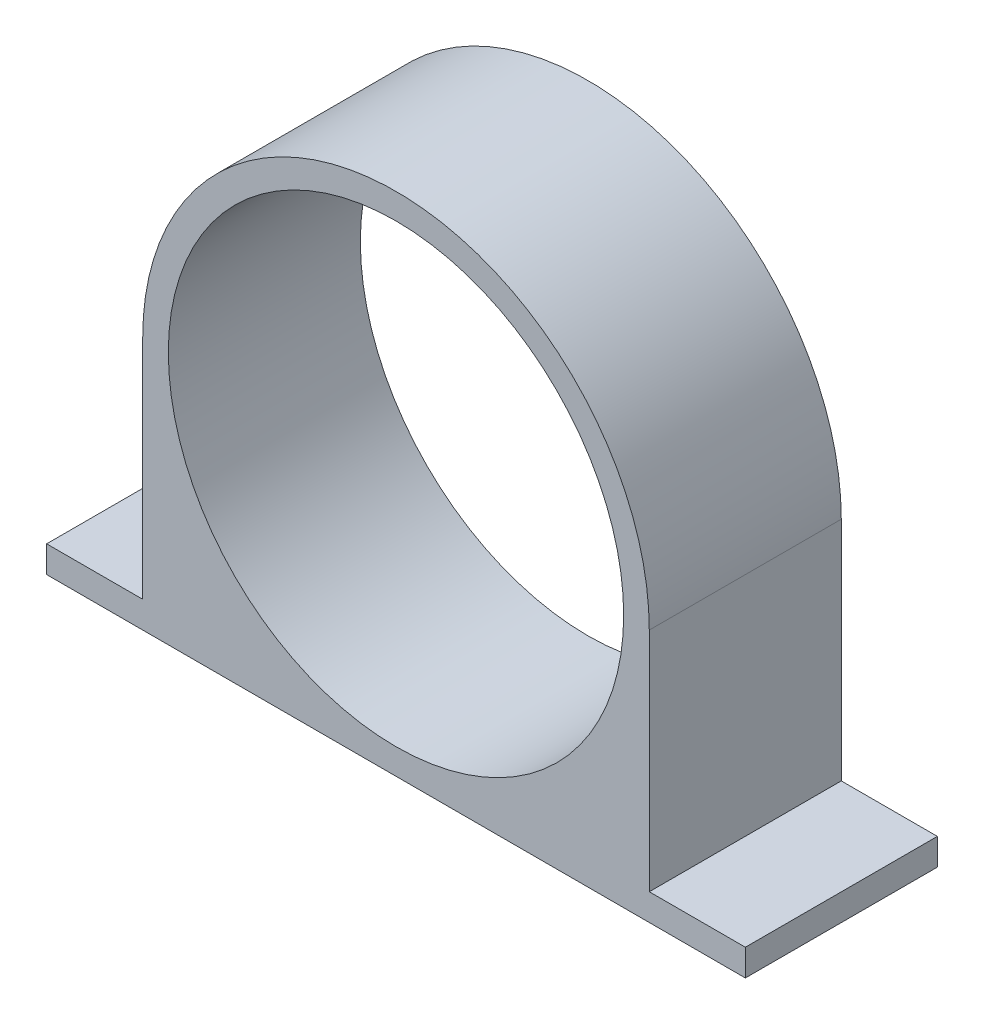
ISO-10303-21;
HEADER;
FILE_DESCRIPTION(('STEP AP214'),'2;1');
FILE_NAME('part.step','',(''),(''),'','','');
FILE_SCHEMA(('AUTOMOTIVE_DESIGN { 1 0 10303 214 1 1 1 1 }'));
ENDSEC;
DATA;
#1=APPLICATION_CONTEXT('core data for automotive mechanical design processes');
#2=APPLICATION_PROTOCOL_DEFINITION('international standard','automotive_design',2000,#1);
#3=PRODUCT_CONTEXT('',#1,'mechanical');
#4=PRODUCT('Part','Part','',(#3));
#5=PRODUCT_RELATED_PRODUCT_CATEGORY('part','',(#4));
#6=PRODUCT_DEFINITION_FORMATION('','',#4);
#7=PRODUCT_DEFINITION_CONTEXT('part definition',#1,'design');
#8=PRODUCT_DEFINITION('design','',#6,#7);
#9=PRODUCT_DEFINITION_SHAPE('','',#8);
#10=(LENGTH_UNIT() NAMED_UNIT(*) SI_UNIT(.MILLI.,.METRE.));
#11=(NAMED_UNIT(*) PLANE_ANGLE_UNIT() SI_UNIT($,.RADIAN.));
#12=(NAMED_UNIT(*) SI_UNIT($,.STERADIAN.) SOLID_ANGLE_UNIT());
#13=UNCERTAINTY_MEASURE_WITH_UNIT(LENGTH_MEASURE(1.E-05),#10,'distance_accuracy_value','');
#14=(GEOMETRIC_REPRESENTATION_CONTEXT(3) GLOBAL_UNCERTAINTY_ASSIGNED_CONTEXT((#13)) GLOBAL_UNIT_ASSIGNED_CONTEXT((#10,
#11,#12)) REPRESENTATION_CONTEXT('',''));
#15=CARTESIAN_POINT('',(0.,0.,0.));
#16=DIRECTION('',(0.,0.,1.));
#17=DIRECTION('',(1.,0.,0.));
#18=AXIS2_PLACEMENT_3D('',#15,#16,#17);
#19=CARTESIAN_POINT('',(0.,0.,25.3));
#20=DIRECTION('',(0.,0.,-1.));
#21=DIRECTION('',(-1.,0.,0.));
#22=AXIS2_PLACEMENT_3D('',#19,#20,#21);
#23=CYLINDRICAL_SURFACE('',#22,33.375);
#24=CARTESIAN_POINT('',(0.,0.,25.3));
#25=DIRECTION('',(0.,0.,1.));
#26=DIRECTION('',(1.,0.,0.));
#27=AXIS2_PLACEMENT_3D('',#24,#25,#26);
#28=CIRCLE('',#27,33.375);
#29=CARTESIAN_POINT('',(33.375,0.,25.3));
#30=VERTEX_POINT('',#29);
#31=CARTESIAN_POINT('',(-33.375,0.,25.3));
#32=VERTEX_POINT('',#31);
#33=EDGE_CURVE('E145',#30,#32,#28,.T.);
#34=ORIENTED_EDGE('',*,*,#33,.F.);
#35=DIRECTION('',(0.,0.,-1.));
#36=VECTOR('',#35,1.);
#37=CARTESIAN_POINT('',(33.375,0.,0.));
#38=LINE('',#37,#36);
#39=CARTESIAN_POINT('',(33.375,0.,0.));
#40=VERTEX_POINT('',#39);
#41=EDGE_CURVE('E140',#30,#40,#38,.T.);
#42=ORIENTED_EDGE('',*,*,#41,.T.);
#43=CARTESIAN_POINT('',(0.,0.,0.));
#44=DIRECTION('',(0.,0.,1.));
#45=DIRECTION('',(1.,0.,0.));
#46=AXIS2_PLACEMENT_3D('',#43,#44,#45);
#47=CIRCLE('',#46,33.375);
#48=CARTESIAN_POINT('',(-33.375,0.,0.));
#49=VERTEX_POINT('',#48);
#50=EDGE_CURVE('E147',#40,#49,#47,.T.);
#51=ORIENTED_EDGE('',*,*,#50,.T.);
#52=DIRECTION('',(0.,0.,1.));
#53=VECTOR('',#52,1.);
#54=CARTESIAN_POINT('',(-33.375,0.,0.));
#55=LINE('',#54,#53);
#56=EDGE_CURVE('E137',#49,#32,#55,.T.);
#57=ORIENTED_EDGE('',*,*,#56,.T.);
#58=EDGE_LOOP('',(#34,#42,#51,#57));
#59=FACE_BOUND('',#58,.T.);
#60=ADVANCED_FACE('F63',(#59),#23,.T.);
#61=CARTESIAN_POINT('',(0.,0.,0.));
#62=DIRECTION('',(0.,0.,1.));
#63=DIRECTION('',(1.,0.,0.));
#64=AXIS2_PLACEMENT_3D('',#61,#62,#63);
#65=PLANE('',#64);
#66=CARTESIAN_POINT('',(0.,0.,0.));
#67=DIRECTION('',(0.,0.,-1.));
#68=DIRECTION('',(-1.,0.,0.));
#69=AXIS2_PLACEMENT_3D('',#66,#67,#68);
#70=CIRCLE('',#69,30.);
#71=CARTESIAN_POINT('',(-30.,0.,0.));
#72=VERTEX_POINT('',#71);
#73=EDGE_CURVE('E190',#72,#72,#70,.T.);
#74=ORIENTED_EDGE('',*,*,#73,.F.);
#75=EDGE_LOOP('',(#74));
#76=FACE_BOUND('',#75,.T.);
#77=ORIENTED_EDGE('',*,*,#50,.F.);
#78=DIRECTION('',(0.,1.,0.));
#79=VECTOR('',#78,1.);
#80=CARTESIAN_POINT('',(33.375,-33.3,0.));
#81=LINE('',#80,#79);
#82=CARTESIAN_POINT('',(33.375,-29.8633159844854,0.));
#83=VERTEX_POINT('',#82);
#84=EDGE_CURVE('E186',#83,#40,#81,.T.);
#85=ORIENTED_EDGE('',*,*,#84,.F.);
#86=DIRECTION('',(-1.,0.,0.));
#87=VECTOR('',#86,1.);
#88=CARTESIAN_POINT('',(-46.035,-29.8633159844854,0.));
#89=LINE('',#88,#87);
#90=CARTESIAN_POINT('',(46.035,-29.8633159844854,0.));
#91=VERTEX_POINT('',#90);
#92=EDGE_CURVE('E168',#91,#83,#89,.T.);
#93=ORIENTED_EDGE('',*,*,#92,.F.);
#94=DIRECTION('',(0.,1.,0.));
#95=VECTOR('',#94,1.);
#96=CARTESIAN_POINT('',(46.035,-29.8633159844854,0.));
#97=LINE('',#96,#95);
#98=CARTESIAN_POINT('',(46.035,-33.375,0.));
#99=VERTEX_POINT('',#98);
#100=EDGE_CURVE('E172',#99,#91,#97,.T.);
#101=ORIENTED_EDGE('',*,*,#100,.F.);
#102=DIRECTION('',(1.,0.,0.));
#103=VECTOR('',#102,1.);
#104=CARTESIAN_POINT('',(-46.035,-33.375,0.));
#105=LINE('',#104,#103);
#106=CARTESIAN_POINT('',(-46.035,-33.375,0.));
#107=VERTEX_POINT('',#106);
#108=EDGE_CURVE('E174',#107,#99,#105,.T.);
#109=ORIENTED_EDGE('',*,*,#108,.F.);
#110=DIRECTION('',(0.,-1.,0.));
#111=VECTOR('',#110,1.);
#112=CARTESIAN_POINT('',(-46.035,-29.8633159844854,0.));
#113=LINE('',#112,#111);
#114=CARTESIAN_POINT('',(-46.035,-29.8633159844854,0.));
#115=VERTEX_POINT('',#114);
#116=EDGE_CURVE('E176',#115,#107,#113,.T.);
#117=ORIENTED_EDGE('',*,*,#116,.F.);
#118=CARTESIAN_POINT('',(-33.375,-29.8633159844854,0.));
#119=VERTEX_POINT('',#118);
#120=EDGE_CURVE('E105',#119,#115,#89,.T.);
#121=ORIENTED_EDGE('',*,*,#120,.F.);
#122=DIRECTION('',(0.,1.,0.));
#123=VECTOR('',#122,1.);
#124=CARTESIAN_POINT('',(-33.375,-33.3,0.));
#125=LINE('',#124,#123);
#126=EDGE_CURVE('E179',#119,#49,#125,.T.);
#127=ORIENTED_EDGE('',*,*,#126,.T.);
#128=EDGE_LOOP('',(#77,#85,#93,#101,#109,#117,#121,#127));
#129=FACE_BOUND('',#128,.T.);
#130=ADVANCED_FACE('F201',(#76,#129),#65,.F.);
#131=CARTESIAN_POINT('',(0.,0.,25.3));
#132=DIRECTION('',(0.,0.,1.));
#133=DIRECTION('',(1.,0.,0.));
#134=AXIS2_PLACEMENT_3D('',#131,#132,#133);
#135=PLANE('',#134);
#136=CARTESIAN_POINT('',(0.,0.,25.3));
#137=DIRECTION('',(0.,0.,1.));
#138=DIRECTION('',(1.,0.,0.));
#139=AXIS2_PLACEMENT_3D('',#136,#137,#138);
#140=CIRCLE('',#139,30.);
#141=CARTESIAN_POINT('',(30.,0.,25.3));
#142=VERTEX_POINT('',#141);
#143=EDGE_CURVE('E66',#142,#142,#140,.T.);
#144=ORIENTED_EDGE('',*,*,#143,.F.);
#145=EDGE_LOOP('',(#144));
#146=FACE_BOUND('',#145,.T.);
#147=DIRECTION('',(0.,1.,0.));
#148=VECTOR('',#147,1.);
#149=CARTESIAN_POINT('',(33.375,-33.3,25.3));
#150=LINE('',#149,#148);
#151=CARTESIAN_POINT('',(33.375,-29.8633159844854,25.3));
#152=VERTEX_POINT('',#151);
#153=EDGE_CURVE('E139',#152,#30,#150,.T.);
#154=ORIENTED_EDGE('',*,*,#153,.T.);
#155=ORIENTED_EDGE('',*,*,#33,.T.);
#156=DIRECTION('',(0.,1.,0.));
#157=VECTOR('',#156,1.);
#158=CARTESIAN_POINT('',(-33.375,-33.3,25.3));
#159=LINE('',#158,#157);
#160=CARTESIAN_POINT('',(-33.375,-29.8633159844854,25.3));
#161=VERTEX_POINT('',#160);
#162=EDGE_CURVE('E78',#161,#32,#159,.T.);
#163=ORIENTED_EDGE('',*,*,#162,.F.);
#164=DIRECTION('',(-1.,0.,0.));
#165=VECTOR('',#164,1.);
#166=CARTESIAN_POINT('',(-46.035,-29.8633159844854,25.3));
#167=LINE('',#166,#165);
#168=CARTESIAN_POINT('',(-46.035,-29.8633159844854,25.3));
#169=VERTEX_POINT('',#168);
#170=EDGE_CURVE('E84',#161,#169,#167,.T.);
#171=ORIENTED_EDGE('',*,*,#170,.T.);
#172=DIRECTION('',(0.,-1.,0.));
#173=VECTOR('',#172,1.);
#174=CARTESIAN_POINT('',(-46.035,-29.8633159844854,25.3));
#175=LINE('',#174,#173);
#176=CARTESIAN_POINT('',(-46.035,-33.375,25.3));
#177=VERTEX_POINT('',#176);
#178=EDGE_CURVE('E171',#169,#177,#175,.T.);
#179=ORIENTED_EDGE('',*,*,#178,.T.);
#180=DIRECTION('',(1.,0.,0.));
#181=VECTOR('',#180,1.);
#182=CARTESIAN_POINT('',(-46.035,-33.375,25.3));
#183=LINE('',#182,#181);
#184=CARTESIAN_POINT('',(46.035,-33.375,25.3));
#185=VERTEX_POINT('',#184);
#186=EDGE_CURVE('E113',#177,#185,#183,.T.);
#187=ORIENTED_EDGE('',*,*,#186,.T.);
#188=DIRECTION('',(0.,1.,0.));
#189=VECTOR('',#188,1.);
#190=CARTESIAN_POINT('',(46.035,-29.8633159844854,25.3));
#191=LINE('',#190,#189);
#192=CARTESIAN_POINT('',(46.035,-29.8633159844854,25.3));
#193=VERTEX_POINT('',#192);
#194=EDGE_CURVE('E181',#185,#193,#191,.T.);
#195=ORIENTED_EDGE('',*,*,#194,.T.);
#196=EDGE_CURVE('E167',#193,#152,#167,.T.);
#197=ORIENTED_EDGE('',*,*,#196,.T.);
#198=EDGE_LOOP('',(#154,#155,#163,#171,#179,#187,#195,#197));
#199=FACE_BOUND('',#198,.T.);
#200=ADVANCED_FACE('F149',(#146,#199),#135,.T.);
#201=CARTESIAN_POINT('',(-46.035,-33.375,25.3));
#202=DIRECTION('',(0.,1.,0.));
#203=DIRECTION('',(-1.,0.,0.));
#204=AXIS2_PLACEMENT_3D('',#201,#202,#203);
#205=PLANE('',#204);
#206=DIRECTION('',(0.,0.,-1.));
#207=VECTOR('',#206,1.);
#208=CARTESIAN_POINT('',(46.035,-33.375,25.3));
#209=LINE('',#208,#207);
#210=EDGE_CURVE('E159',#185,#99,#209,.T.);
#211=ORIENTED_EDGE('',*,*,#210,.F.);
#212=ORIENTED_EDGE('',*,*,#186,.F.);
#213=DIRECTION('',(0.,0.,-1.));
#214=VECTOR('',#213,1.);
#215=CARTESIAN_POINT('',(-46.035,-33.375,25.3));
#216=LINE('',#215,#214);
#217=EDGE_CURVE('E155',#177,#107,#216,.T.);
#218=ORIENTED_EDGE('',*,*,#217,.T.);
#219=ORIENTED_EDGE('',*,*,#108,.T.);
#220=EDGE_LOOP('',(#211,#212,#218,#219));
#221=FACE_BOUND('',#220,.T.);
#222=ADVANCED_FACE('F200',(#221),#205,.F.);
#223=CARTESIAN_POINT('',(-46.035,-29.8633159844854,25.3));
#224=DIRECTION('',(0.,-1.,0.));
#225=DIRECTION('',(1.,0.,0.));
#226=AXIS2_PLACEMENT_3D('',#223,#224,#225);
#227=PLANE('',#226);
#228=ORIENTED_EDGE('',*,*,#170,.F.);
#229=DIRECTION('',(0.,0.,-1.));
#230=VECTOR('',#229,1.);
#231=CARTESIAN_POINT('',(-33.375,-29.8633159844854,25.3));
#232=LINE('',#231,#230);
#233=EDGE_CURVE('E12',#161,#119,#232,.T.);
#234=ORIENTED_EDGE('',*,*,#233,.T.);
#235=ORIENTED_EDGE('',*,*,#120,.T.);
#236=DIRECTION('',(0.,0.,-1.));
#237=VECTOR('',#236,1.);
#238=CARTESIAN_POINT('',(-46.035,-29.8633159844854,25.3));
#239=LINE('',#238,#237);
#240=EDGE_CURVE('E165',#169,#115,#239,.T.);
#241=ORIENTED_EDGE('',*,*,#240,.F.);
#242=EDGE_LOOP('',(#228,#234,#235,#241));
#243=FACE_BOUND('',#242,.T.);
#244=ADVANCED_FACE('F208',(#243),#227,.F.);
#245=ORIENTED_EDGE('',*,*,#92,.T.);
#246=DIRECTION('',(0.,0.,1.));
#247=VECTOR('',#246,1.);
#248=CARTESIAN_POINT('',(33.375,-29.8633159844854,25.3));
#249=LINE('',#248,#247);
#250=EDGE_CURVE('E71',#83,#152,#249,.T.);
#251=ORIENTED_EDGE('',*,*,#250,.T.);
#252=ORIENTED_EDGE('',*,*,#196,.F.);
#253=DIRECTION('',(0.,0.,-1.));
#254=VECTOR('',#253,1.);
#255=CARTESIAN_POINT('',(46.035,-29.8633159844854,25.3));
#256=LINE('',#255,#254);
#257=EDGE_CURVE('E162',#193,#91,#256,.T.);
#258=ORIENTED_EDGE('',*,*,#257,.T.);
#259=EDGE_LOOP('',(#245,#251,#252,#258));
#260=FACE_BOUND('',#259,.T.);
#261=ADVANCED_FACE('F228',(#260),#227,.F.);
#262=CARTESIAN_POINT('',(-46.035,-29.8633159844854,25.3));
#263=DIRECTION('',(1.,0.,0.));
#264=DIRECTION('',(0.,0.,-1.));
#265=AXIS2_PLACEMENT_3D('',#262,#263,#264);
#266=PLANE('',#265);
#267=ORIENTED_EDGE('',*,*,#116,.T.);
#268=ORIENTED_EDGE('',*,*,#217,.F.);
#269=ORIENTED_EDGE('',*,*,#178,.F.);
#270=ORIENTED_EDGE('',*,*,#240,.T.);
#271=EDGE_LOOP('',(#267,#268,#269,#270));
#272=FACE_BOUND('',#271,.T.);
#273=ADVANCED_FACE('F237',(#272),#266,.F.);
#274=CARTESIAN_POINT('',(46.035,-29.8633159844854,25.3));
#275=DIRECTION('',(-1.,0.,0.));
#276=DIRECTION('',(0.,0.,1.));
#277=AXIS2_PLACEMENT_3D('',#274,#275,#276);
#278=PLANE('',#277);
#279=ORIENTED_EDGE('',*,*,#100,.T.);
#280=ORIENTED_EDGE('',*,*,#257,.F.);
#281=ORIENTED_EDGE('',*,*,#194,.F.);
#282=ORIENTED_EDGE('',*,*,#210,.T.);
#283=EDGE_LOOP('',(#279,#280,#281,#282));
#284=FACE_BOUND('',#283,.T.);
#285=ADVANCED_FACE('F221',(#284),#278,.F.);
#286=CARTESIAN_POINT('',(33.375,-33.3,0.));
#287=DIRECTION('',(1.,0.,0.));
#288=DIRECTION('',(0.,0.,-1.));
#289=AXIS2_PLACEMENT_3D('',#286,#287,#288);
#290=PLANE('',#289);
#291=ORIENTED_EDGE('',*,*,#250,.F.);
#292=ORIENTED_EDGE('',*,*,#84,.T.);
#293=ORIENTED_EDGE('',*,*,#41,.F.);
#294=ORIENTED_EDGE('',*,*,#153,.F.);
#295=EDGE_LOOP('',(#291,#292,#293,#294));
#296=FACE_BOUND('',#295,.T.);
#297=ADVANCED_FACE('F243',(#296),#290,.T.);
#298=CARTESIAN_POINT('',(-33.375,-33.3,0.));
#299=DIRECTION('',(-1.,0.,0.));
#300=DIRECTION('',(0.,0.,1.));
#301=AXIS2_PLACEMENT_3D('',#298,#299,#300);
#302=PLANE('',#301);
#303=ORIENTED_EDGE('',*,*,#233,.F.);
#304=ORIENTED_EDGE('',*,*,#162,.T.);
#305=ORIENTED_EDGE('',*,*,#56,.F.);
#306=ORIENTED_EDGE('',*,*,#126,.F.);
#307=EDGE_LOOP('',(#303,#304,#305,#306));
#308=FACE_BOUND('',#307,.T.);
#309=ADVANCED_FACE('F136',(#308),#302,.T.);
#310=CARTESIAN_POINT('',(0.,0.,33.3));
#311=DIRECTION('',(0.,0.,-1.));
#312=DIRECTION('',(-1.,0.,0.));
#313=AXIS2_PLACEMENT_3D('',#310,#311,#312);
#314=CYLINDRICAL_SURFACE('',#313,30.);
#315=ORIENTED_EDGE('',*,*,#143,.T.);
#316=EDGE_LOOP('',(#315));
#317=FACE_BOUND('',#316,.T.);
#318=ORIENTED_EDGE('',*,*,#73,.T.);
#319=EDGE_LOOP('',(#318));
#320=FACE_BOUND('',#319,.T.);
#321=ADVANCED_FACE('F197',(#317,#320),#314,.F.);
#322=CLOSED_SHELL('',(#60,#130,#200,#222,#244,#261,#273,#285,#297,#309,#321));
#323=MANIFOLD_SOLID_BREP('B2',#322);
#324=ADVANCED_BREP_SHAPE_REPRESENTATION('',(#18,#323),#14);
#325=SHAPE_DEFINITION_REPRESENTATION(#9,#324);
ENDSEC;
END-ISO-10303-21;
